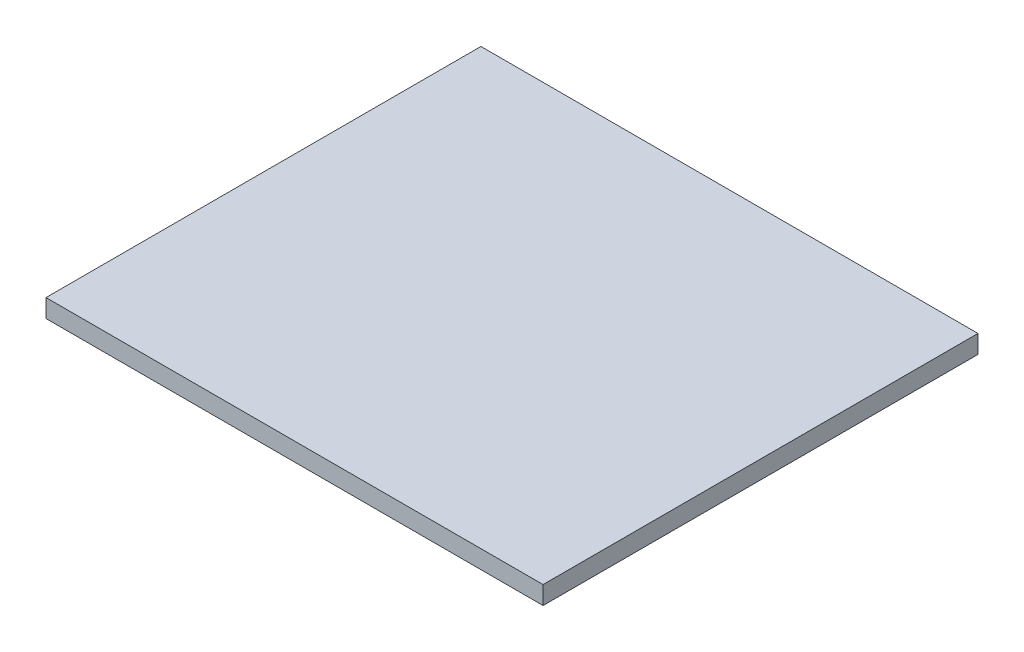
ISO-10303-21;
HEADER;
FILE_DESCRIPTION(('STEP AP214'),'2;1');
FILE_NAME('part.step','',(''),(''),'','','');
FILE_SCHEMA(('AUTOMOTIVE_DESIGN { 1 0 10303 214 1 1 1 1 }'));
ENDSEC;
DATA;
#1=APPLICATION_CONTEXT('core data for automotive mechanical design processes');
#2=APPLICATION_PROTOCOL_DEFINITION('international standard','automotive_design',2000,#1);
#3=PRODUCT_CONTEXT('',#1,'mechanical');
#4=PRODUCT('Part','Part','',(#3));
#5=PRODUCT_RELATED_PRODUCT_CATEGORY('part','',(#4));
#6=PRODUCT_DEFINITION_FORMATION('','',#4);
#7=PRODUCT_DEFINITION_CONTEXT('part definition',#1,'design');
#8=PRODUCT_DEFINITION('design','',#6,#7);
#9=PRODUCT_DEFINITION_SHAPE('','',#8);
#10=(LENGTH_UNIT() NAMED_UNIT(*) SI_UNIT(.MILLI.,.METRE.));
#11=(NAMED_UNIT(*) PLANE_ANGLE_UNIT() SI_UNIT($,.RADIAN.));
#12=(NAMED_UNIT(*) SI_UNIT($,.STERADIAN.) SOLID_ANGLE_UNIT());
#13=UNCERTAINTY_MEASURE_WITH_UNIT(LENGTH_MEASURE(1.E-05),#10,'distance_accuracy_value','');
#14=(GEOMETRIC_REPRESENTATION_CONTEXT(3) GLOBAL_UNCERTAINTY_ASSIGNED_CONTEXT((#13)) GLOBAL_UNIT_ASSIGNED_CONTEXT((#10,
#11,#12)) REPRESENTATION_CONTEXT('',''));
#15=CARTESIAN_POINT('',(0.,0.,0.));
#16=DIRECTION('',(0.,0.,1.));
#17=DIRECTION('',(1.,0.,0.));
#18=AXIS2_PLACEMENT_3D('',#15,#16,#17);
#19=CARTESIAN_POINT('',(4.1,0.3,-3.5875));
#20=DIRECTION('',(-1.,0.,0.));
#21=DIRECTION('',(0.,0.,1.));
#22=AXIS2_PLACEMENT_3D('',#19,#20,#21);
#23=PLANE('',#22);
#24=DIRECTION('',(0.,0.,-1.));
#25=VECTOR('',#24,1.);
#26=CARTESIAN_POINT('',(4.1,0.,-3.5875));
#27=LINE('',#26,#25);
#28=CARTESIAN_POINT('',(4.1,0.,3.5875));
#29=VERTEX_POINT('',#28);
#30=CARTESIAN_POINT('',(4.1,0.,-3.5875));
#31=VERTEX_POINT('',#30);
#32=EDGE_CURVE('E119',#29,#31,#27,.T.);
#33=ORIENTED_EDGE('',*,*,#32,.T.);
#34=DIRECTION('',(0.,-1.,0.));
#35=VECTOR('',#34,1.);
#36=CARTESIAN_POINT('',(4.1,0.3,-3.5875));
#37=LINE('',#36,#35);
#38=CARTESIAN_POINT('',(4.1,0.3,-3.5875));
#39=VERTEX_POINT('',#38);
#40=EDGE_CURVE('E11',#39,#31,#37,.T.);
#41=ORIENTED_EDGE('',*,*,#40,.F.);
#42=DIRECTION('',(0.,0.,-1.));
#43=VECTOR('',#42,1.);
#44=CARTESIAN_POINT('',(4.1,0.3,-3.5875));
#45=LINE('',#44,#43);
#46=CARTESIAN_POINT('',(4.1,0.3,3.5875));
#47=VERTEX_POINT('',#46);
#48=EDGE_CURVE('E102',#47,#39,#45,.T.);
#49=ORIENTED_EDGE('',*,*,#48,.F.);
#50=DIRECTION('',(0.,-1.,0.));
#51=VECTOR('',#50,1.);
#52=CARTESIAN_POINT('',(4.1,0.3,3.5875));
#53=LINE('',#52,#51);
#54=EDGE_CURVE('E115',#47,#29,#53,.T.);
#55=ORIENTED_EDGE('',*,*,#54,.T.);
#56=EDGE_LOOP('',(#33,#41,#49,#55));
#57=FACE_BOUND('',#56,.T.);
#58=ADVANCED_FACE('F42',(#57),#23,.F.);
#59=CARTESIAN_POINT('',(-4.1,0.3,-3.5875));
#60=DIRECTION('',(0.,0.,1.));
#61=DIRECTION('',(1.,0.,0.));
#62=AXIS2_PLACEMENT_3D('',#59,#60,#61);
#63=PLANE('',#62);
#64=DIRECTION('',(-1.,0.,0.));
#65=VECTOR('',#64,1.);
#66=CARTESIAN_POINT('',(-4.1,0.,-3.5875));
#67=LINE('',#66,#65);
#68=CARTESIAN_POINT('',(-4.1,0.,-3.5875));
#69=VERTEX_POINT('',#68);
#70=EDGE_CURVE('E107',#31,#69,#67,.T.);
#71=ORIENTED_EDGE('',*,*,#70,.T.);
#72=DIRECTION('',(0.,-1.,0.));
#73=VECTOR('',#72,1.);
#74=CARTESIAN_POINT('',(-4.1,0.3,-3.5875));
#75=LINE('',#74,#73);
#76=CARTESIAN_POINT('',(-4.1,0.3,-3.5875));
#77=VERTEX_POINT('',#76);
#78=EDGE_CURVE('E51',#77,#69,#75,.T.);
#79=ORIENTED_EDGE('',*,*,#78,.F.);
#80=DIRECTION('',(-1.,0.,0.));
#81=VECTOR('',#80,1.);
#82=CARTESIAN_POINT('',(-4.1,0.3,-3.5875));
#83=LINE('',#82,#81);
#84=EDGE_CURVE('E97',#39,#77,#83,.T.);
#85=ORIENTED_EDGE('',*,*,#84,.F.);
#86=ORIENTED_EDGE('',*,*,#40,.T.);
#87=EDGE_LOOP('',(#71,#79,#85,#86));
#88=FACE_BOUND('',#87,.T.);
#89=ADVANCED_FACE('F106',(#88),#63,.F.);
#90=CARTESIAN_POINT('',(-4.1,0.3,-3.5875));
#91=DIRECTION('',(1.,0.,0.));
#92=DIRECTION('',(0.,0.,-1.));
#93=AXIS2_PLACEMENT_3D('',#90,#91,#92);
#94=PLANE('',#93);
#95=DIRECTION('',(0.,0.,1.));
#96=VECTOR('',#95,1.);
#97=CARTESIAN_POINT('',(-4.1,0.,-3.5875));
#98=LINE('',#97,#96);
#99=CARTESIAN_POINT('',(-4.1,0.,3.5875));
#100=VERTEX_POINT('',#99);
#101=EDGE_CURVE('E82',#69,#100,#98,.T.);
#102=ORIENTED_EDGE('',*,*,#101,.T.);
#103=DIRECTION('',(0.,-1.,0.));
#104=VECTOR('',#103,1.);
#105=CARTESIAN_POINT('',(-4.1,0.3,3.5875));
#106=LINE('',#105,#104);
#107=CARTESIAN_POINT('',(-4.1,0.3,3.5875));
#108=VERTEX_POINT('',#107);
#109=EDGE_CURVE('E109',#108,#100,#106,.T.);
#110=ORIENTED_EDGE('',*,*,#109,.F.);
#111=DIRECTION('',(0.,0.,1.));
#112=VECTOR('',#111,1.);
#113=CARTESIAN_POINT('',(-4.1,0.3,-3.5875));
#114=LINE('',#113,#112);
#115=EDGE_CURVE('E100',#77,#108,#114,.T.);
#116=ORIENTED_EDGE('',*,*,#115,.F.);
#117=ORIENTED_EDGE('',*,*,#78,.T.);
#118=EDGE_LOOP('',(#102,#110,#116,#117));
#119=FACE_BOUND('',#118,.T.);
#120=ADVANCED_FACE('F110',(#119),#94,.F.);
#121=CARTESIAN_POINT('',(-4.1,0.3,3.5875));
#122=DIRECTION('',(0.,0.,-1.));
#123=DIRECTION('',(-1.,0.,0.));
#124=AXIS2_PLACEMENT_3D('',#121,#122,#123);
#125=PLANE('',#124);
#126=DIRECTION('',(1.,0.,0.));
#127=VECTOR('',#126,1.);
#128=CARTESIAN_POINT('',(-4.1,0.,3.5875));
#129=LINE('',#128,#127);
#130=EDGE_CURVE('E89',#100,#29,#129,.T.);
#131=ORIENTED_EDGE('',*,*,#130,.T.);
#132=ORIENTED_EDGE('',*,*,#54,.F.);
#133=DIRECTION('',(1.,0.,0.));
#134=VECTOR('',#133,1.);
#135=CARTESIAN_POINT('',(-4.1,0.3,3.5875));
#136=LINE('',#135,#134);
#137=EDGE_CURVE('E62',#108,#47,#136,.T.);
#138=ORIENTED_EDGE('',*,*,#137,.F.);
#139=ORIENTED_EDGE('',*,*,#109,.T.);
#140=EDGE_LOOP('',(#131,#132,#138,#139));
#141=FACE_BOUND('',#140,.T.);
#142=ADVANCED_FACE('F131',(#141),#125,.F.);
#143=CARTESIAN_POINT('',(4.1,0.3,3.5875));
#144=DIRECTION('',(0.,1.,0.));
#145=DIRECTION('',(0.,0.,1.));
#146=AXIS2_PLACEMENT_3D('',#143,#144,#145);
#147=PLANE('',#146);
#148=ORIENTED_EDGE('',*,*,#48,.T.);
#149=ORIENTED_EDGE('',*,*,#84,.T.);
#150=ORIENTED_EDGE('',*,*,#115,.T.);
#151=ORIENTED_EDGE('',*,*,#137,.T.);
#152=EDGE_LOOP('',(#148,#149,#150,#151));
#153=FACE_BOUND('',#152,.T.);
#154=ADVANCED_FACE('F98',(#153),#147,.T.);
#155=CARTESIAN_POINT('',(4.1,0.,3.5875));
#156=DIRECTION('',(0.,1.,0.));
#157=DIRECTION('',(0.,0.,1.));
#158=AXIS2_PLACEMENT_3D('',#155,#156,#157);
#159=PLANE('',#158);
#160=ORIENTED_EDGE('',*,*,#32,.F.);
#161=ORIENTED_EDGE('',*,*,#130,.F.);
#162=ORIENTED_EDGE('',*,*,#101,.F.);
#163=ORIENTED_EDGE('',*,*,#70,.F.);
#164=EDGE_LOOP('',(#160,#161,#162,#163));
#165=FACE_BOUND('',#164,.T.);
#166=ADVANCED_FACE('F134',(#165),#159,.F.);
#167=CLOSED_SHELL('',(#58,#89,#120,#142,#154,#166));
#168=MANIFOLD_SOLID_BREP('B2',#167);
#169=ADVANCED_BREP_SHAPE_REPRESENTATION('',(#18,#168),#14);
#170=SHAPE_DEFINITION_REPRESENTATION(#9,#169);
ENDSEC;
END-ISO-10303-21;
